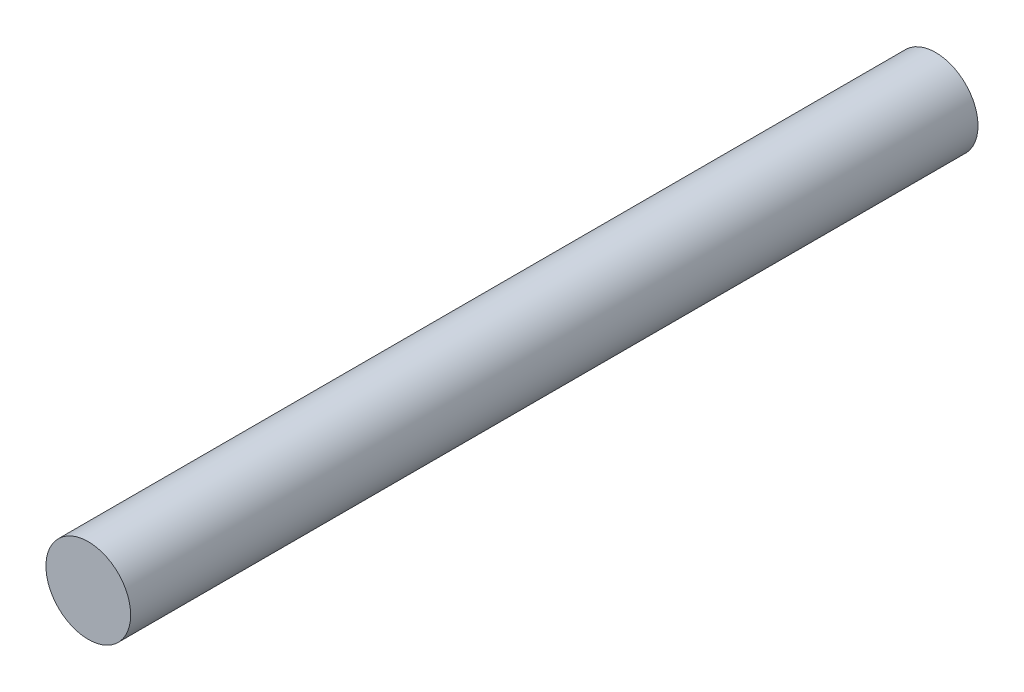
ISO-10303-21;
HEADER;
FILE_DESCRIPTION(('STEP AP214'),'2;1');
FILE_NAME('part.step','',(''),(''),'','','');
FILE_SCHEMA(('AUTOMOTIVE_DESIGN { 1 0 10303 214 1 1 1 1 }'));
ENDSEC;
DATA;
#1=APPLICATION_CONTEXT('core data for automotive mechanical design processes');
#2=APPLICATION_PROTOCOL_DEFINITION('international standard','automotive_design',2000,#1);
#3=PRODUCT_CONTEXT('',#1,'mechanical');
#4=PRODUCT('Part','Part','',(#3));
#5=PRODUCT_RELATED_PRODUCT_CATEGORY('part','',(#4));
#6=PRODUCT_DEFINITION_FORMATION('','',#4);
#7=PRODUCT_DEFINITION_CONTEXT('part definition',#1,'design');
#8=PRODUCT_DEFINITION('design','',#6,#7);
#9=PRODUCT_DEFINITION_SHAPE('','',#8);
#10=(LENGTH_UNIT() NAMED_UNIT(*) SI_UNIT(.MILLI.,.METRE.));
#11=(NAMED_UNIT(*) PLANE_ANGLE_UNIT() SI_UNIT($,.RADIAN.));
#12=(NAMED_UNIT(*) SI_UNIT($,.STERADIAN.) SOLID_ANGLE_UNIT());
#13=UNCERTAINTY_MEASURE_WITH_UNIT(LENGTH_MEASURE(1.E-05),#10,'distance_accuracy_value','');
#14=(GEOMETRIC_REPRESENTATION_CONTEXT(3) GLOBAL_UNCERTAINTY_ASSIGNED_CONTEXT((#13)) GLOBAL_UNIT_ASSIGNED_CONTEXT((#10,
#11,#12)) REPRESENTATION_CONTEXT('',''));
#15=CARTESIAN_POINT('',(0.,0.,0.));
#16=DIRECTION('',(0.,0.,1.));
#17=DIRECTION('',(1.,0.,0.));
#18=AXIS2_PLACEMENT_3D('',#15,#16,#17);
#19=CARTESIAN_POINT('',(0.,0.,10.));
#20=DIRECTION('',(0.,0.,-1.));
#21=DIRECTION('',(-1.,0.,0.));
#22=AXIS2_PLACEMENT_3D('',#19,#20,#21);
#23=CYLINDRICAL_SURFACE('',#22,1.);
#24=CARTESIAN_POINT('',(0.,0.,10.));
#25=DIRECTION('',(0.,0.,1.));
#26=DIRECTION('',(1.,0.,0.));
#27=AXIS2_PLACEMENT_3D('',#24,#25,#26);
#28=CIRCLE('',#27,1.);
#29=CARTESIAN_POINT('',(1.,0.,10.));
#30=VERTEX_POINT('',#29);
#31=EDGE_CURVE('E10',#30,#30,#28,.T.);
#32=ORIENTED_EDGE('',*,*,#31,.F.);
#33=EDGE_LOOP('',(#32));
#34=FACE_BOUND('',#33,.T.);
#35=CARTESIAN_POINT('',(0.,0.,-10.));
#36=DIRECTION('',(0.,0.,1.));
#37=DIRECTION('',(1.,0.,0.));
#38=AXIS2_PLACEMENT_3D('',#35,#36,#37);
#39=CIRCLE('',#38,1.);
#40=CARTESIAN_POINT('',(1.,0.,-10.));
#41=VERTEX_POINT('',#40);
#42=EDGE_CURVE('E32',#41,#41,#39,.T.);
#43=ORIENTED_EDGE('',*,*,#42,.T.);
#44=EDGE_LOOP('',(#43));
#45=FACE_BOUND('',#44,.T.);
#46=ADVANCED_FACE('F29',(#34,#45),#23,.T.);
#47=CARTESIAN_POINT('',(0.,0.,10.));
#48=DIRECTION('',(0.,0.,1.));
#49=DIRECTION('',(1.,0.,0.));
#50=AXIS2_PLACEMENT_3D('',#47,#48,#49);
#51=PLANE('',#50);
#52=ORIENTED_EDGE('',*,*,#31,.T.);
#53=EDGE_LOOP('',(#52));
#54=FACE_BOUND('',#53,.T.);
#55=ADVANCED_FACE('F44',(#54),#51,.T.);
#56=CARTESIAN_POINT('',(0.,0.,-10.));
#57=DIRECTION('',(0.,0.,1.));
#58=DIRECTION('',(1.,0.,0.));
#59=AXIS2_PLACEMENT_3D('',#56,#57,#58);
#60=PLANE('',#59);
#61=ORIENTED_EDGE('',*,*,#42,.F.);
#62=EDGE_LOOP('',(#61));
#63=FACE_BOUND('',#62,.T.);
#64=ADVANCED_FACE('F42',(#63),#60,.F.);
#65=CLOSED_SHELL('',(#46,#55,#64));
#66=MANIFOLD_SOLID_BREP('B2',#65);
#67=ADVANCED_BREP_SHAPE_REPRESENTATION('',(#18,#66),#14);
#68=SHAPE_DEFINITION_REPRESENTATION(#9,#67);
ENDSEC;
END-ISO-10303-21;
